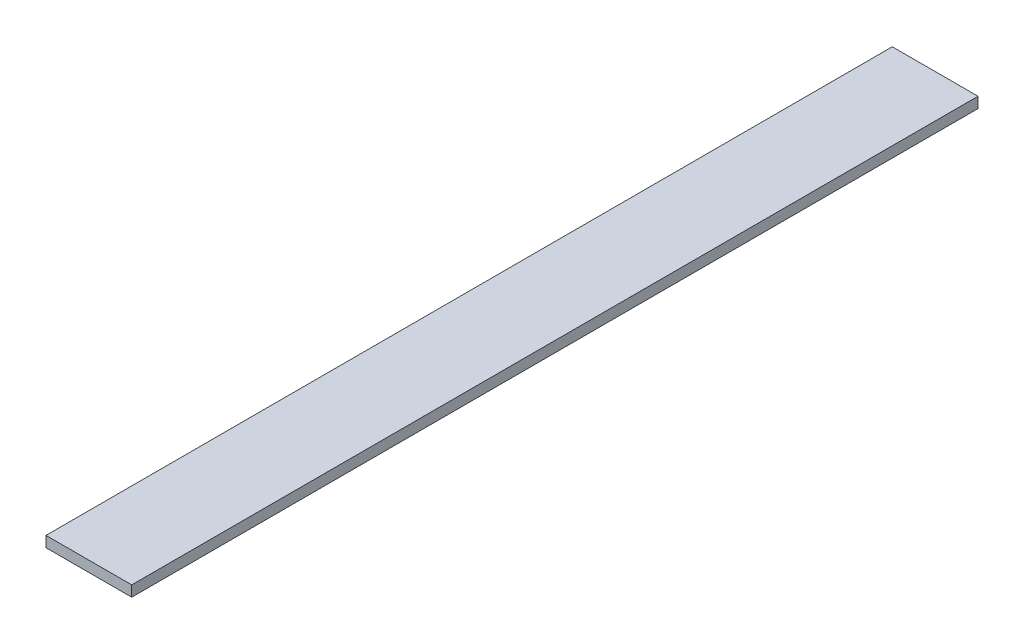
ISO-10303-21;
HEADER;
FILE_DESCRIPTION(('STEP AP214'),'2;1');
FILE_NAME('part.step','',(''),(''),'','','');
FILE_SCHEMA(('AUTOMOTIVE_DESIGN { 1 0 10303 214 1 1 1 1 }'));
ENDSEC;
DATA;
#1=APPLICATION_CONTEXT('core data for automotive mechanical design processes');
#2=APPLICATION_PROTOCOL_DEFINITION('international standard','automotive_design',2000,#1);
#3=PRODUCT_CONTEXT('',#1,'mechanical');
#4=PRODUCT('Part','Part','',(#3));
#5=PRODUCT_RELATED_PRODUCT_CATEGORY('part','',(#4));
#6=PRODUCT_DEFINITION_FORMATION('','',#4);
#7=PRODUCT_DEFINITION_CONTEXT('part definition',#1,'design');
#8=PRODUCT_DEFINITION('design','',#6,#7);
#9=PRODUCT_DEFINITION_SHAPE('','',#8);
#10=(LENGTH_UNIT() NAMED_UNIT(*) SI_UNIT(.MILLI.,.METRE.));
#11=(NAMED_UNIT(*) PLANE_ANGLE_UNIT() SI_UNIT($,.RADIAN.));
#12=(NAMED_UNIT(*) SI_UNIT($,.STERADIAN.) SOLID_ANGLE_UNIT());
#13=UNCERTAINTY_MEASURE_WITH_UNIT(LENGTH_MEASURE(1.E-05),#10,'distance_accuracy_value','');
#14=(GEOMETRIC_REPRESENTATION_CONTEXT(3) GLOBAL_UNCERTAINTY_ASSIGNED_CONTEXT((#13)) GLOBAL_UNIT_ASSIGNED_CONTEXT((#10,
#11,#12)) REPRESENTATION_CONTEXT('',''));
#15=CARTESIAN_POINT('',(0.,0.,0.));
#16=DIRECTION('',(0.,0.,1.));
#17=DIRECTION('',(1.,0.,0.));
#18=AXIS2_PLACEMENT_3D('',#15,#16,#17);
#19=CARTESIAN_POINT('',(25.4,6.35,250.825));
#20=DIRECTION('',(-1.,0.,0.));
#21=DIRECTION('',(0.,0.,1.));
#22=AXIS2_PLACEMENT_3D('',#19,#20,#21);
#23=PLANE('',#22);
#24=DIRECTION('',(0.,0.,-1.));
#25=VECTOR('',#24,1.);
#26=CARTESIAN_POINT('',(25.4,0.,250.825));
#27=LINE('',#26,#25);
#28=CARTESIAN_POINT('',(25.4,0.,250.825));
#29=VERTEX_POINT('',#28);
#30=CARTESIAN_POINT('',(25.4,0.,-250.825));
#31=VERTEX_POINT('',#30);
#32=EDGE_CURVE('E107',#29,#31,#27,.T.);
#33=ORIENTED_EDGE('',*,*,#32,.T.);
#34=DIRECTION('',(0.,-1.,0.));
#35=VECTOR('',#34,1.);
#36=CARTESIAN_POINT('',(25.4,6.35,-250.825));
#37=LINE('',#36,#35);
#38=CARTESIAN_POINT('',(25.4,6.35,-250.825));
#39=VERTEX_POINT('',#38);
#40=EDGE_CURVE('E11',#39,#31,#37,.T.);
#41=ORIENTED_EDGE('',*,*,#40,.F.);
#42=DIRECTION('',(0.,0.,-1.));
#43=VECTOR('',#42,1.);
#44=CARTESIAN_POINT('',(25.4,6.35,250.825));
#45=LINE('',#44,#43);
#46=CARTESIAN_POINT('',(25.4,6.35,250.825));
#47=VERTEX_POINT('',#46);
#48=EDGE_CURVE('E90',#47,#39,#45,.T.);
#49=ORIENTED_EDGE('',*,*,#48,.F.);
#50=DIRECTION('',(0.,-1.,0.));
#51=VECTOR('',#50,1.);
#52=CARTESIAN_POINT('',(25.4,6.35,250.825));
#53=LINE('',#52,#51);
#54=EDGE_CURVE('E103',#47,#29,#53,.T.);
#55=ORIENTED_EDGE('',*,*,#54,.T.);
#56=EDGE_LOOP('',(#33,#41,#49,#55));
#57=FACE_BOUND('',#56,.T.);
#58=ADVANCED_FACE('F38',(#57),#23,.F.);
#59=CARTESIAN_POINT('',(-25.4,6.35,-250.825));
#60=DIRECTION('',(0.,0.,1.));
#61=DIRECTION('',(1.,0.,0.));
#62=AXIS2_PLACEMENT_3D('',#59,#60,#61);
#63=PLANE('',#62);
#64=DIRECTION('',(-1.,0.,0.));
#65=VECTOR('',#64,1.);
#66=CARTESIAN_POINT('',(-25.4,0.,-250.825));
#67=LINE('',#66,#65);
#68=CARTESIAN_POINT('',(-25.4,0.,-250.825));
#69=VERTEX_POINT('',#68);
#70=EDGE_CURVE('E95',#31,#69,#67,.T.);
#71=ORIENTED_EDGE('',*,*,#70,.T.);
#72=DIRECTION('',(0.,-1.,0.));
#73=VECTOR('',#72,1.);
#74=CARTESIAN_POINT('',(-25.4,6.35,-250.825));
#75=LINE('',#74,#73);
#76=CARTESIAN_POINT('',(-25.4,6.35,-250.825));
#77=VERTEX_POINT('',#76);
#78=EDGE_CURVE('E47',#77,#69,#75,.T.);
#79=ORIENTED_EDGE('',*,*,#78,.F.);
#80=DIRECTION('',(-1.,0.,0.));
#81=VECTOR('',#80,1.);
#82=CARTESIAN_POINT('',(-25.4,6.35,-250.825));
#83=LINE('',#82,#81);
#84=EDGE_CURVE('E85',#39,#77,#83,.T.);
#85=ORIENTED_EDGE('',*,*,#84,.F.);
#86=ORIENTED_EDGE('',*,*,#40,.T.);
#87=EDGE_LOOP('',(#71,#79,#85,#86));
#88=FACE_BOUND('',#87,.T.);
#89=ADVANCED_FACE('F94',(#88),#63,.F.);
#90=CARTESIAN_POINT('',(-25.4,6.35,250.825));
#91=DIRECTION('',(1.,0.,0.));
#92=DIRECTION('',(0.,0.,-1.));
#93=AXIS2_PLACEMENT_3D('',#90,#91,#92);
#94=PLANE('',#93);
#95=DIRECTION('',(0.,0.,1.));
#96=VECTOR('',#95,1.);
#97=CARTESIAN_POINT('',(-25.4,0.,250.825));
#98=LINE('',#97,#96);
#99=CARTESIAN_POINT('',(-25.4,0.,250.825));
#100=VERTEX_POINT('',#99);
#101=EDGE_CURVE('E72',#69,#100,#98,.T.);
#102=ORIENTED_EDGE('',*,*,#101,.T.);
#103=DIRECTION('',(0.,-1.,0.));
#104=VECTOR('',#103,1.);
#105=CARTESIAN_POINT('',(-25.4,6.35,250.825));
#106=LINE('',#105,#104);
#107=CARTESIAN_POINT('',(-25.4,6.35,250.825));
#108=VERTEX_POINT('',#107);
#109=EDGE_CURVE('E97',#108,#100,#106,.T.);
#110=ORIENTED_EDGE('',*,*,#109,.F.);
#111=DIRECTION('',(0.,0.,1.));
#112=VECTOR('',#111,1.);
#113=CARTESIAN_POINT('',(-25.4,6.35,250.825));
#114=LINE('',#113,#112);
#115=EDGE_CURVE('E88',#77,#108,#114,.T.);
#116=ORIENTED_EDGE('',*,*,#115,.F.);
#117=ORIENTED_EDGE('',*,*,#78,.T.);
#118=EDGE_LOOP('',(#102,#110,#116,#117));
#119=FACE_BOUND('',#118,.T.);
#120=ADVANCED_FACE('F98',(#119),#94,.F.);
#121=CARTESIAN_POINT('',(-25.4,6.35,250.825));
#122=DIRECTION('',(0.,0.,-1.));
#123=DIRECTION('',(-1.,0.,0.));
#124=AXIS2_PLACEMENT_3D('',#121,#122,#123);
#125=PLANE('',#124);
#126=DIRECTION('',(1.,0.,0.));
#127=VECTOR('',#126,1.);
#128=CARTESIAN_POINT('',(-25.4,0.,250.825));
#129=LINE('',#128,#127);
#130=EDGE_CURVE('E78',#100,#29,#129,.T.);
#131=ORIENTED_EDGE('',*,*,#130,.T.);
#132=ORIENTED_EDGE('',*,*,#54,.F.);
#133=DIRECTION('',(1.,0.,0.));
#134=VECTOR('',#133,1.);
#135=CARTESIAN_POINT('',(-25.4,6.35,250.825));
#136=LINE('',#135,#134);
#137=EDGE_CURVE('E55',#108,#47,#136,.T.);
#138=ORIENTED_EDGE('',*,*,#137,.F.);
#139=ORIENTED_EDGE('',*,*,#109,.T.);
#140=EDGE_LOOP('',(#131,#132,#138,#139));
#141=FACE_BOUND('',#140,.T.);
#142=ADVANCED_FACE('F121',(#141),#125,.F.);
#143=CARTESIAN_POINT('',(0.,6.35,0.));
#144=DIRECTION('',(0.,-1.,0.));
#145=DIRECTION('',(0.,0.,-1.));
#146=AXIS2_PLACEMENT_3D('',#143,#144,#145);
#147=PLANE('',#146);
#148=ORIENTED_EDGE('',*,*,#48,.T.);
#149=ORIENTED_EDGE('',*,*,#84,.T.);
#150=ORIENTED_EDGE('',*,*,#115,.T.);
#151=ORIENTED_EDGE('',*,*,#137,.T.);
#152=EDGE_LOOP('',(#148,#149,#150,#151));
#153=FACE_BOUND('',#152,.T.);
#154=ADVANCED_FACE('F86',(#153),#147,.F.);
#155=CARTESIAN_POINT('',(0.,0.,0.));
#156=DIRECTION('',(0.,-1.,0.));
#157=DIRECTION('',(0.,0.,-1.));
#158=AXIS2_PLACEMENT_3D('',#155,#156,#157);
#159=PLANE('',#158);
#160=ORIENTED_EDGE('',*,*,#32,.F.);
#161=ORIENTED_EDGE('',*,*,#130,.F.);
#162=ORIENTED_EDGE('',*,*,#101,.F.);
#163=ORIENTED_EDGE('',*,*,#70,.F.);
#164=EDGE_LOOP('',(#160,#161,#162,#163));
#165=FACE_BOUND('',#164,.T.);
#166=ADVANCED_FACE('F124',(#165),#159,.T.);
#167=CLOSED_SHELL('',(#58,#89,#120,#142,#154,#166));
#168=MANIFOLD_SOLID_BREP('B2',#167);
#169=ADVANCED_BREP_SHAPE_REPRESENTATION('',(#18,#168),#14);
#170=SHAPE_DEFINITION_REPRESENTATION(#9,#169);
ENDSEC;
END-ISO-10303-21;
